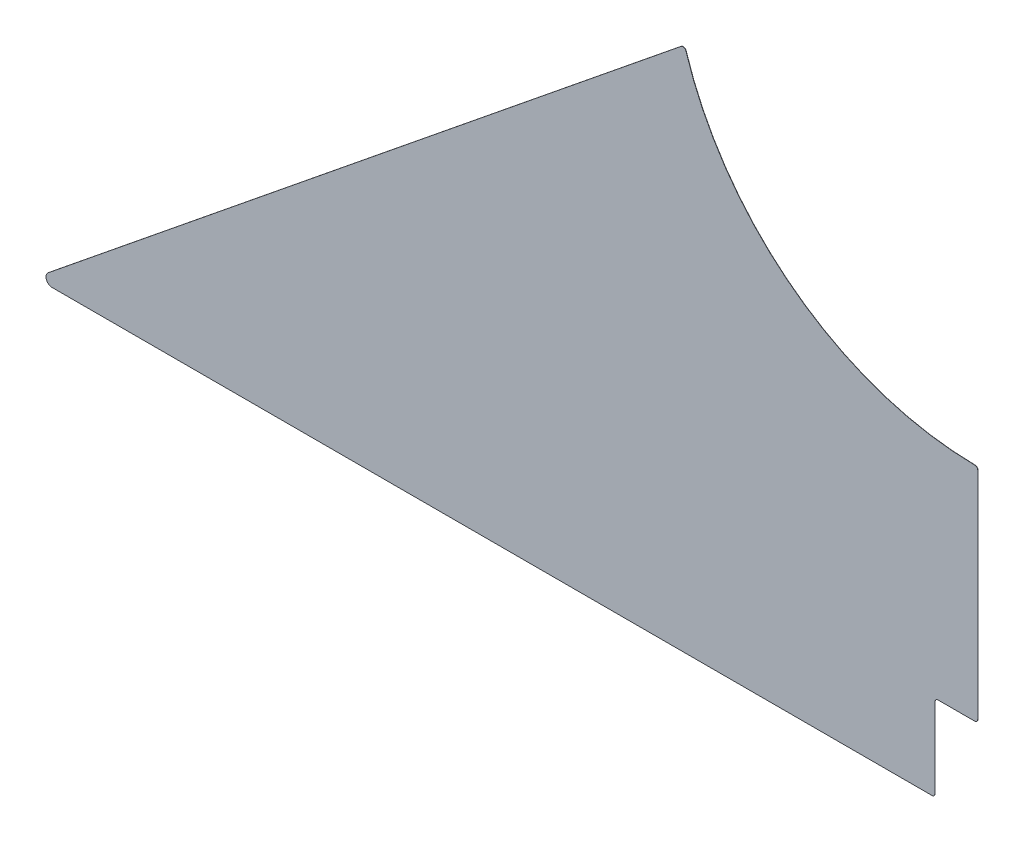
ISO-10303-21;
HEADER;
FILE_DESCRIPTION(('STEP AP214'),'2;1');
FILE_NAME('part.step','',(''),(''),'','','');
FILE_SCHEMA(('AUTOMOTIVE_DESIGN { 1 0 10303 214 1 1 1 1 }'));
ENDSEC;
DATA;
#1=APPLICATION_CONTEXT('core data for automotive mechanical design processes');
#2=APPLICATION_PROTOCOL_DEFINITION('international standard','automotive_design',2000,#1);
#3=PRODUCT_CONTEXT('',#1,'mechanical');
#4=PRODUCT('Part','Part','',(#3));
#5=PRODUCT_RELATED_PRODUCT_CATEGORY('part','',(#4));
#6=PRODUCT_DEFINITION_FORMATION('','',#4);
#7=PRODUCT_DEFINITION_CONTEXT('part definition',#1,'design');
#8=PRODUCT_DEFINITION('design','',#6,#7);
#9=PRODUCT_DEFINITION_SHAPE('','',#8);
#10=(LENGTH_UNIT() NAMED_UNIT(*) SI_UNIT(.MILLI.,.METRE.));
#11=(NAMED_UNIT(*) PLANE_ANGLE_UNIT() SI_UNIT($,.RADIAN.));
#12=(NAMED_UNIT(*) SI_UNIT($,.STERADIAN.) SOLID_ANGLE_UNIT());
#13=UNCERTAINTY_MEASURE_WITH_UNIT(LENGTH_MEASURE(1.E-05),#10,'distance_accuracy_value','');
#14=(GEOMETRIC_REPRESENTATION_CONTEXT(3) GLOBAL_UNCERTAINTY_ASSIGNED_CONTEXT((#13)) GLOBAL_UNIT_ASSIGNED_CONTEXT((#10,
#11,#12)) REPRESENTATION_CONTEXT('',''));
#15=CARTESIAN_POINT('',(0.,0.,0.));
#16=DIRECTION('',(0.,0.,1.));
#17=DIRECTION('',(1.,0.,0.));
#18=AXIS2_PLACEMENT_3D('',#15,#16,#17);
#19=CARTESIAN_POINT('',(-1292.225,-3.17670318081826E-13,1.5875));
#20=DIRECTION('',(0.629320391049834,-0.777145961456974,0.));
#21=DIRECTION('',(0.777145961456974,0.629320391049834,0.));
#22=AXIS2_PLACEMENT_3D('',#19,#20,#21);
#23=PLANE('',#22);
#24=DIRECTION('',(0.,0.,-1.));
#25=VECTOR('',#24,1.);
#26=CARTESIAN_POINT('',(-307.961691260842,797.04071187665,1.5875));
#27=LINE('',#26,#25);
#28=CARTESIAN_POINT('',(-307.961691260842,797.04071187665,1.5875));
#29=VERTEX_POINT('',#28);
#30=CARTESIAN_POINT('',(-307.961691260842,797.04071187665,1.3335));
#31=VERTEX_POINT('',#30);
#32=EDGE_CURVE('E175',#29,#31,#27,.T.);
#33=ORIENTED_EDGE('',*,*,#32,.T.);
#34=DIRECTION('',(-0.777145961456974,-0.629320391049834,0.));
#35=VECTOR('',#34,1.);
#36=CARTESIAN_POINT('',(-1292.225,-3.17658004608335E-13,1.3334999999999));
#37=LINE('',#36,#35);
#38=CARTESIAN_POINT('',(-964.74529205127,265.187838692242,1.33349999999993));
#39=VERTEX_POINT('',#38);
#40=EDGE_CURVE('E192',#31,#39,#37,.T.);
#41=ORIENTED_EDGE('',*,*,#40,.T.);
#42=DIRECTION('',(0.,0.,1.));
#43=VECTOR('',#42,1.);
#44=CARTESIAN_POINT('',(-964.74529205127,265.187838692242,1.5875));
#45=LINE('',#44,#43);
#46=CARTESIAN_POINT('',(-964.74529205127,265.187838692242,1.5875));
#47=VERTEX_POINT('',#46);
#48=EDGE_CURVE('E58',#39,#47,#45,.T.);
#49=ORIENTED_EDGE('',*,*,#48,.T.);
#50=DIRECTION('',(-0.777145961456974,-0.629320391049834,0.));
#51=VECTOR('',#50,1.);
#52=CARTESIAN_POINT('',(-1292.225,-3.17670318081826E-13,1.5875));
#53=LINE('',#52,#51);
#54=EDGE_CURVE('E220',#29,#47,#53,.T.);
#55=ORIENTED_EDGE('',*,*,#54,.F.);
#56=EDGE_LOOP('',(#33,#41,#49,#55));
#57=FACE_BOUND('',#56,.T.);
#58=ADVANCED_FACE('F35',(#57),#23,.F.);
#59=CARTESIAN_POINT('',(0.,890.5875,1.5875));
#60=DIRECTION('',(0.,0.,-1.));
#61=DIRECTION('',(-1.,0.,0.));
#62=AXIS2_PLACEMENT_3D('',#59,#60,#61);
#63=CYLINDRICAL_SURFACE('',#62,317.5);
#64=DIRECTION('',(0.,0.,-1.));
#65=VECTOR('',#64,1.);
#66=CARTESIAN_POINT('',(-3.14356435643564,573.103062581192,1.5875));
#67=LINE('',#66,#65);
#68=CARTESIAN_POINT('',(-3.14356435643564,573.103062581192,1.5875));
#69=VERTEX_POINT('',#68);
#70=CARTESIAN_POINT('',(-3.14356435643564,573.103062581192,1.33349999999997));
#71=VERTEX_POINT('',#70);
#72=EDGE_CURVE('E155',#69,#71,#67,.T.);
#73=ORIENTED_EDGE('',*,*,#72,.T.);
#74=CARTESIAN_POINT('',(0.,890.5875,1.33350000000001));
#75=DIRECTION('',(0.,0.,1.));
#76=DIRECTION('',(0.,-1.,0.));
#77=AXIS2_PLACEMENT_3D('',#74,#75,#76);
#78=CIRCLE('',#77,317.5);
#79=CARTESIAN_POINT('',(-302.934256454712,795.523909355469,1.3335));
#80=VERTEX_POINT('',#79);
#81=EDGE_CURVE('E131',#71,#80,#78,.F.);
#82=ORIENTED_EDGE('',*,*,#81,.T.);
#83=DIRECTION('',(0.,0.,-1.));
#84=VECTOR('',#83,1.);
#85=CARTESIAN_POINT('',(-302.934256454712,795.523909355469,1.5875));
#86=LINE('',#85,#84);
#87=CARTESIAN_POINT('',(-302.934256454712,795.523909355469,1.5875));
#88=VERTEX_POINT('',#87);
#89=EDGE_CURVE('E225',#80,#88,#86,.F.);
#90=ORIENTED_EDGE('',*,*,#89,.T.);
#91=CARTESIAN_POINT('',(0.,890.5875,1.5875));
#92=DIRECTION('',(0.,0.,-1.));
#93=DIRECTION('',(1.,0.,0.));
#94=AXIS2_PLACEMENT_3D('',#91,#92,#93);
#95=CIRCLE('',#94,317.5);
#96=EDGE_CURVE('E222',#69,#88,#95,.T.);
#97=ORIENTED_EDGE('',*,*,#96,.F.);
#98=EDGE_LOOP('',(#73,#82,#90,#97));
#99=FACE_BOUND('',#98,.T.);
#100=ADVANCED_FACE('F228',(#99),#63,.F.);
#101=CARTESIAN_POINT('',(0.,890.5875,1.5875));
#102=DIRECTION('',(0.,0.,1.));
#103=DIRECTION('',(1.,0.,0.));
#104=AXIS2_PLACEMENT_3D('',#101,#102,#103);
#105=PLANE('',#104);
#106=ORIENTED_EDGE('',*,*,#54,.T.);
#107=CARTESIAN_POINT('',(-960.749107568104,260.25296183699,1.5875));
#108=DIRECTION('',(0.,0.,1.));
#109=DIRECTION('',(1.,0.,0.));
#110=AXIS2_PLACEMENT_3D('',#107,#108,#109);
#111=CIRCLE('',#110,6.35);
#112=CARTESIAN_POINT('',(-960.749107568104,253.90296183699,1.5875));
#113=VERTEX_POINT('',#112);
#114=EDGE_CURVE('E50',#47,#113,#111,.T.);
#115=ORIENTED_EDGE('',*,*,#114,.T.);
#116=DIRECTION('',(-1.,0.,0.));
#117=VECTOR('',#116,1.);
#118=CARTESIAN_POINT('',(-44.45,253.902961836991,1.5875));
#119=LINE('',#118,#117);
#120=CARTESIAN_POINT('',(-47.625,253.902961836991,1.5875));
#121=VERTEX_POINT('',#120);
#122=EDGE_CURVE('E188',#121,#113,#119,.T.);
#123=ORIENTED_EDGE('',*,*,#122,.F.);
#124=CARTESIAN_POINT('',(-47.625,257.077961836991,1.5875));
#125=DIRECTION('',(0.,0.,1.));
#126=DIRECTION('',(1.,0.,0.));
#127=AXIS2_PLACEMENT_3D('',#124,#125,#126);
#128=CIRCLE('',#127,3.175);
#129=CARTESIAN_POINT('',(-44.45,257.077961836991,1.5875));
#130=VERTEX_POINT('',#129);
#131=EDGE_CURVE('E153',#121,#130,#128,.T.);
#132=ORIENTED_EDGE('',*,*,#131,.T.);
#133=DIRECTION('',(0.,-1.,0.));
#134=VECTOR('',#133,1.);
#135=CARTESIAN_POINT('',(-44.4499999999999,-3.33066907387547E-13,1.5875));
#136=LINE('',#135,#134);
#137=CARTESIAN_POINT('',(-44.45,339.725,1.5875));
#138=VERTEX_POINT('',#137);
#139=EDGE_CURVE('E214',#138,#130,#136,.T.);
#140=ORIENTED_EDGE('',*,*,#139,.F.);
#141=CARTESIAN_POINT('',(-41.275,339.725,1.5875));
#142=DIRECTION('',(0.,0.,1.));
#143=DIRECTION('',(1.,0.,0.));
#144=AXIS2_PLACEMENT_3D('',#141,#142,#143);
#145=CIRCLE('',#144,3.175);
#146=CARTESIAN_POINT('',(-41.275,342.9,1.5875));
#147=VERTEX_POINT('',#146);
#148=EDGE_CURVE('E178',#138,#147,#145,.F.);
#149=ORIENTED_EDGE('',*,*,#148,.T.);
#150=DIRECTION('',(-1.,0.,0.));
#151=VECTOR('',#150,1.);
#152=CARTESIAN_POINT('',(-44.45,342.9,1.5875));
#153=LINE('',#152,#151);
#154=CARTESIAN_POINT('',(-3.175,342.9,1.5875));
#155=VERTEX_POINT('',#154);
#156=EDGE_CURVE('E217',#155,#147,#153,.T.);
#157=ORIENTED_EDGE('',*,*,#156,.F.);
#158=CARTESIAN_POINT('',(-3.175,346.075,1.5875));
#159=DIRECTION('',(0.,0.,1.));
#160=DIRECTION('',(1.,0.,0.));
#161=AXIS2_PLACEMENT_3D('',#158,#159,#160);
#162=CIRCLE('',#161,3.175);
#163=CARTESIAN_POINT('',(0.,346.075,1.5875));
#164=VERTEX_POINT('',#163);
#165=EDGE_CURVE('E160',#155,#164,#162,.T.);
#166=ORIENTED_EDGE('',*,*,#165,.T.);
#167=DIRECTION('',(0.,-1.,0.));
#168=VECTOR('',#167,1.);
#169=CARTESIAN_POINT('',(0.,0.,1.5875));
#170=LINE('',#169,#168);
#171=CARTESIAN_POINT('',(0.,569.928218207004,1.5875));
#172=VERTEX_POINT('',#171);
#173=EDGE_CURVE('E212',#172,#164,#170,.T.);
#174=ORIENTED_EDGE('',*,*,#173,.F.);
#175=CARTESIAN_POINT('',(-3.175,569.928218207004,1.5875));
#176=DIRECTION('',(0.,0.,1.));
#177=DIRECTION('',(1.,0.,0.));
#178=AXIS2_PLACEMENT_3D('',#175,#176,#177);
#179=CIRCLE('',#178,3.175);
#180=EDGE_CURVE('E150',#172,#69,#179,.T.);
#181=ORIENTED_EDGE('',*,*,#180,.T.);
#182=ORIENTED_EDGE('',*,*,#96,.T.);
#183=CARTESIAN_POINT('',(-305.963599019259,794.573273449024,1.5875));
#184=DIRECTION('',(0.,0.,1.));
#185=DIRECTION('',(1.,0.,0.));
#186=AXIS2_PLACEMENT_3D('',#183,#184,#185);
#187=CIRCLE('',#186,3.175);
#188=EDGE_CURVE('E151',#88,#29,#187,.T.);
#189=ORIENTED_EDGE('',*,*,#188,.T.);
#190=EDGE_LOOP('',(#106,#115,#123,#132,#140,#149,#157,#166,#174,#181,#182,#189));
#191=FACE_BOUND('',#190,.T.);
#192=ADVANCED_FACE('F231',(#191),#105,.T.);
#193=CARTESIAN_POINT('',(-44.4499999999999,-3.33066907387547E-13,0.));
#194=DIRECTION('',(-1.,0.,0.));
#195=DIRECTION('',(0.,-1.,0.));
#196=AXIS2_PLACEMENT_3D('',#193,#194,#195);
#197=PLANE('',#196);
#198=DIRECTION('',(0.,0.,1.));
#199=VECTOR('',#198,1.);
#200=CARTESIAN_POINT('',(-44.45,257.077961836991,0.));
#201=LINE('',#200,#199);
#202=CARTESIAN_POINT('',(-44.45,257.077961836991,1.33349999999993));
#203=VERTEX_POINT('',#202);
#204=EDGE_CURVE('E163',#130,#203,#201,.F.);
#205=ORIENTED_EDGE('',*,*,#204,.T.);
#206=DIRECTION('',(0.,1.,0.));
#207=VECTOR('',#206,1.);
#208=CARTESIAN_POINT('',(-44.4499999999999,-3.33230135994949E-13,1.3334999999999));
#209=LINE('',#208,#207);
#210=CARTESIAN_POINT('',(-44.45,339.725,1.33349999999994));
#211=VERTEX_POINT('',#210);
#212=EDGE_CURVE('E200',#203,#211,#209,.T.);
#213=ORIENTED_EDGE('',*,*,#212,.T.);
#214=DIRECTION('',(0.,0.,1.));
#215=VECTOR('',#214,1.);
#216=CARTESIAN_POINT('',(-44.45,339.725,1.5875));
#217=LINE('',#216,#215);
#218=EDGE_CURVE('E166',#211,#138,#217,.T.);
#219=ORIENTED_EDGE('',*,*,#218,.T.);
#220=ORIENTED_EDGE('',*,*,#139,.T.);
#221=EDGE_LOOP('',(#205,#213,#219,#220));
#222=FACE_BOUND('',#221,.T.);
#223=ADVANCED_FACE('F274',(#222),#197,.F.);
#224=CARTESIAN_POINT('',(-44.45,342.9,0.));
#225=DIRECTION('',(0.,1.,0.));
#226=DIRECTION('',(0.,0.,1.));
#227=AXIS2_PLACEMENT_3D('',#224,#225,#226);
#228=PLANE('',#227);
#229=DIRECTION('',(0.,0.,1.));
#230=VECTOR('',#229,1.);
#231=CARTESIAN_POINT('',(-41.275,342.9,0.));
#232=LINE('',#231,#230);
#233=CARTESIAN_POINT('',(-41.275,342.9,1.33349999999994));
#234=VERTEX_POINT('',#233);
#235=EDGE_CURVE('E170',#147,#234,#232,.F.);
#236=ORIENTED_EDGE('',*,*,#235,.T.);
#237=DIRECTION('',(1.,0.,0.));
#238=VECTOR('',#237,1.);
#239=CARTESIAN_POINT('',(-44.45,342.9,1.33349999999994));
#240=LINE('',#239,#238);
#241=CARTESIAN_POINT('',(-3.175,342.9,1.33349999999994));
#242=VERTEX_POINT('',#241);
#243=EDGE_CURVE('E206',#234,#242,#240,.T.);
#244=ORIENTED_EDGE('',*,*,#243,.T.);
#245=DIRECTION('',(0.,0.,1.));
#246=VECTOR('',#245,1.);
#247=CARTESIAN_POINT('',(-3.175,342.9,0.));
#248=LINE('',#247,#246);
#249=EDGE_CURVE('E168',#242,#155,#248,.T.);
#250=ORIENTED_EDGE('',*,*,#249,.T.);
#251=ORIENTED_EDGE('',*,*,#156,.T.);
#252=EDGE_LOOP('',(#236,#244,#250,#251));
#253=FACE_BOUND('',#252,.T.);
#254=ADVANCED_FACE('F271',(#253),#228,.F.);
#255=CARTESIAN_POINT('',(0.,0.,0.));
#256=DIRECTION('',(-1.,0.,0.));
#257=DIRECTION('',(0.,0.,1.));
#258=AXIS2_PLACEMENT_3D('',#255,#256,#257);
#259=PLANE('',#258);
#260=DIRECTION('',(0.,0.,1.));
#261=VECTOR('',#260,1.);
#262=CARTESIAN_POINT('',(0.,346.075,0.));
#263=LINE('',#262,#261);
#264=CARTESIAN_POINT('',(0.,346.075,1.33349999999994));
#265=VERTEX_POINT('',#264);
#266=EDGE_CURVE('E145',#164,#265,#263,.F.);
#267=ORIENTED_EDGE('',*,*,#266,.T.);
#268=DIRECTION('',(0.,-1.,0.));
#269=VECTOR('',#268,1.);
#270=CARTESIAN_POINT('',(0.,797.748273449024,1.3335));
#271=LINE('',#270,#269);
#272=CARTESIAN_POINT('',(0.,569.928218207004,1.33349999999997));
#273=VERTEX_POINT('',#272);
#274=EDGE_CURVE('E128',#273,#265,#271,.T.);
#275=ORIENTED_EDGE('',*,*,#274,.F.);
#276=DIRECTION('',(0.,0.,-1.));
#277=VECTOR('',#276,1.);
#278=CARTESIAN_POINT('',(0.,569.928218207004,0.));
#279=LINE('',#278,#277);
#280=EDGE_CURVE('E142',#273,#172,#279,.F.);
#281=ORIENTED_EDGE('',*,*,#280,.T.);
#282=ORIENTED_EDGE('',*,*,#173,.T.);
#283=EDGE_LOOP('',(#267,#275,#281,#282));
#284=FACE_BOUND('',#283,.T.);
#285=ADVANCED_FACE('F140',(#284),#259,.F.);
#286=CARTESIAN_POINT('',(-44.45,253.902961836991,0.));
#287=DIRECTION('',(0.,1.,0.));
#288=DIRECTION('',(-1.,0.,0.));
#289=AXIS2_PLACEMENT_3D('',#286,#287,#288);
#290=PLANE('',#289);
#291=DIRECTION('',(0.,0.,1.));
#292=VECTOR('',#291,1.);
#293=CARTESIAN_POINT('',(-960.749107568104,253.90296183699,0.));
#294=LINE('',#293,#292);
#295=CARTESIAN_POINT('',(-960.749107568104,253.902961836991,1.33349999999993));
#296=VERTEX_POINT('',#295);
#297=EDGE_CURVE('E43',#113,#296,#294,.F.);
#298=ORIENTED_EDGE('',*,*,#297,.T.);
#299=DIRECTION('',(1.,0.,0.));
#300=VECTOR('',#299,1.);
#301=CARTESIAN_POINT('',(-967.099107568104,253.902961836991,1.33349999999993));
#302=LINE('',#301,#300);
#303=CARTESIAN_POINT('',(-47.625,253.902961836991,1.33349999999993));
#304=VERTEX_POINT('',#303);
#305=EDGE_CURVE('E146',#296,#304,#302,.T.);
#306=ORIENTED_EDGE('',*,*,#305,.T.);
#307=DIRECTION('',(0.,0.,1.));
#308=VECTOR('',#307,1.);
#309=CARTESIAN_POINT('',(-47.625,253.902961836991,0.));
#310=LINE('',#309,#308);
#311=EDGE_CURVE('E173',#304,#121,#310,.T.);
#312=ORIENTED_EDGE('',*,*,#311,.T.);
#313=ORIENTED_EDGE('',*,*,#122,.T.);
#314=EDGE_LOOP('',(#298,#306,#312,#313));
#315=FACE_BOUND('',#314,.T.);
#316=ADVANCED_FACE('F185',(#315),#290,.F.);
#317=CARTESIAN_POINT('',(-3.175,569.928218207004,1.5875));
#318=DIRECTION('',(0.,0.,-1.));
#319=DIRECTION('',(-1.,0.,0.));
#320=AXIS2_PLACEMENT_3D('',#317,#318,#319);
#321=CYLINDRICAL_SURFACE('',#320,3.175);
#322=CARTESIAN_POINT('',(-3.175,569.928218207004,1.33349999999997));
#323=DIRECTION('',(0.,0.,1.));
#324=DIRECTION('',(0.,-1.,0.));
#325=AXIS2_PLACEMENT_3D('',#322,#323,#324);
#326=CIRCLE('',#325,3.175);
#327=EDGE_CURVE('E125',#71,#273,#326,.F.);
#328=ORIENTED_EDGE('',*,*,#327,.F.);
#329=ORIENTED_EDGE('',*,*,#72,.F.);
#330=ORIENTED_EDGE('',*,*,#180,.F.);
#331=ORIENTED_EDGE('',*,*,#280,.F.);
#332=EDGE_LOOP('',(#328,#329,#330,#331));
#333=FACE_BOUND('',#332,.T.);
#334=ADVANCED_FACE('F149',(#333),#321,.T.);
#335=CARTESIAN_POINT('',(-41.275,339.725,0.));
#336=DIRECTION('',(0.,0.,-1.));
#337=DIRECTION('',(-1.,0.,0.));
#338=AXIS2_PLACEMENT_3D('',#335,#336,#337);
#339=CYLINDRICAL_SURFACE('',#338,3.175);
#340=ORIENTED_EDGE('',*,*,#218,.F.);
#341=CARTESIAN_POINT('',(-41.275,339.725,1.33349999999994));
#342=DIRECTION('',(0.,0.,1.));
#343=DIRECTION('',(0.,-1.,0.));
#344=AXIS2_PLACEMENT_3D('',#341,#342,#343);
#345=CIRCLE('',#344,3.175);
#346=EDGE_CURVE('E203',#211,#234,#345,.F.);
#347=ORIENTED_EDGE('',*,*,#346,.T.);
#348=ORIENTED_EDGE('',*,*,#235,.F.);
#349=ORIENTED_EDGE('',*,*,#148,.F.);
#350=EDGE_LOOP('',(#340,#347,#348,#349));
#351=FACE_BOUND('',#350,.T.);
#352=ADVANCED_FACE('F245',(#351),#339,.F.);
#353=CARTESIAN_POINT('',(-3.175,346.075,0.));
#354=DIRECTION('',(0.,0.,1.));
#355=DIRECTION('',(1.,0.,0.));
#356=AXIS2_PLACEMENT_3D('',#353,#354,#355);
#357=CYLINDRICAL_SURFACE('',#356,3.175);
#358=CARTESIAN_POINT('',(-3.175,346.075,1.33349999999994));
#359=DIRECTION('',(0.,0.,1.));
#360=DIRECTION('',(0.,-1.,0.));
#361=AXIS2_PLACEMENT_3D('',#358,#359,#360);
#362=CIRCLE('',#361,3.175);
#363=EDGE_CURVE('E209',#265,#242,#362,.F.);
#364=ORIENTED_EDGE('',*,*,#363,.F.);
#365=ORIENTED_EDGE('',*,*,#266,.F.);
#366=ORIENTED_EDGE('',*,*,#165,.F.);
#367=ORIENTED_EDGE('',*,*,#249,.F.);
#368=EDGE_LOOP('',(#364,#365,#366,#367));
#369=FACE_BOUND('',#368,.T.);
#370=ADVANCED_FACE('F248',(#369),#357,.T.);
#371=CARTESIAN_POINT('',(-47.625,257.077961836991,0.));
#372=DIRECTION('',(0.,0.,1.));
#373=DIRECTION('',(1.,0.,0.));
#374=AXIS2_PLACEMENT_3D('',#371,#372,#373);
#375=CYLINDRICAL_SURFACE('',#374,3.175);
#376=CARTESIAN_POINT('',(-47.625,257.077961836991,1.33349999999993));
#377=DIRECTION('',(0.,0.,1.));
#378=DIRECTION('',(0.,-1.,0.));
#379=AXIS2_PLACEMENT_3D('',#376,#377,#378);
#380=CIRCLE('',#379,3.175);
#381=EDGE_CURVE('E136',#203,#304,#380,.F.);
#382=ORIENTED_EDGE('',*,*,#381,.F.);
#383=ORIENTED_EDGE('',*,*,#204,.F.);
#384=ORIENTED_EDGE('',*,*,#131,.F.);
#385=ORIENTED_EDGE('',*,*,#311,.F.);
#386=EDGE_LOOP('',(#382,#383,#384,#385));
#387=FACE_BOUND('',#386,.T.);
#388=ADVANCED_FACE('F252',(#387),#375,.T.);
#389=CARTESIAN_POINT('',(-305.963599019259,794.573273449024,1.5875));
#390=DIRECTION('',(0.,0.,-1.));
#391=DIRECTION('',(-1.,0.,0.));
#392=AXIS2_PLACEMENT_3D('',#389,#390,#391);
#393=CYLINDRICAL_SURFACE('',#392,3.175);
#394=CARTESIAN_POINT('',(-305.963599019259,794.573273449024,1.3335));
#395=DIRECTION('',(0.,0.,1.));
#396=DIRECTION('',(0.,-1.,0.));
#397=AXIS2_PLACEMENT_3D('',#394,#395,#396);
#398=CIRCLE('',#397,3.175);
#399=EDGE_CURVE('E194',#31,#80,#398,.F.);
#400=ORIENTED_EDGE('',*,*,#399,.F.);
#401=ORIENTED_EDGE('',*,*,#32,.F.);
#402=ORIENTED_EDGE('',*,*,#188,.F.);
#403=ORIENTED_EDGE('',*,*,#89,.F.);
#404=EDGE_LOOP('',(#400,#401,#402,#403));
#405=FACE_BOUND('',#404,.T.);
#406=ADVANCED_FACE('F234',(#405),#393,.T.);
#407=CARTESIAN_POINT('',(-960.749107568104,260.25296183699,1.5875));
#408=DIRECTION('',(0.,0.,1.));
#409=DIRECTION('',(1.,0.,0.));
#410=AXIS2_PLACEMENT_3D('',#407,#408,#409);
#411=CYLINDRICAL_SURFACE('',#410,6.35);
#412=CARTESIAN_POINT('',(-960.749107568104,260.25296183699,1.33349999999993));
#413=DIRECTION('',(0.,0.,1.));
#414=DIRECTION('',(0.,-1.,0.));
#415=AXIS2_PLACEMENT_3D('',#412,#413,#414);
#416=CIRCLE('',#415,6.35);
#417=EDGE_CURVE('E11',#296,#39,#416,.F.);
#418=ORIENTED_EDGE('',*,*,#417,.F.);
#419=ORIENTED_EDGE('',*,*,#297,.F.);
#420=ORIENTED_EDGE('',*,*,#114,.F.);
#421=ORIENTED_EDGE('',*,*,#48,.F.);
#422=EDGE_LOOP('',(#418,#419,#420,#421));
#423=FACE_BOUND('',#422,.T.);
#424=ADVANCED_FACE('F37',(#423),#411,.T.);
#425=CARTESIAN_POINT('',(-967.099107568104,797.748273449024,1.3335));
#426=DIRECTION('',(0.,0.,1.));
#427=DIRECTION('',(0.,-1.,0.));
#428=AXIS2_PLACEMENT_3D('',#425,#426,#427);
#429=PLANE('',#428);
#430=ORIENTED_EDGE('',*,*,#363,.T.);
#431=ORIENTED_EDGE('',*,*,#243,.F.);
#432=ORIENTED_EDGE('',*,*,#346,.F.);
#433=ORIENTED_EDGE('',*,*,#212,.F.);
#434=ORIENTED_EDGE('',*,*,#381,.T.);
#435=ORIENTED_EDGE('',*,*,#305,.F.);
#436=ORIENTED_EDGE('',*,*,#417,.T.);
#437=ORIENTED_EDGE('',*,*,#40,.F.);
#438=ORIENTED_EDGE('',*,*,#399,.T.);
#439=ORIENTED_EDGE('',*,*,#81,.F.);
#440=ORIENTED_EDGE('',*,*,#327,.T.);
#441=ORIENTED_EDGE('',*,*,#274,.T.);
#442=EDGE_LOOP('',(#430,#431,#432,#433,#434,#435,#436,#437,#438,#439,#440,#441));
#443=FACE_BOUND('',#442,.T.);
#444=ADVANCED_FACE('F127',(#443),#429,.F.);
#445=CLOSED_SHELL('',(#58,#100,#192,#223,#254,#285,#316,#334,#352,#370,#388,#406,#424,#444));
#446=MANIFOLD_SOLID_BREP('B2',#445);
#447=ADVANCED_BREP_SHAPE_REPRESENTATION('',(#18,#446),#14);
#448=SHAPE_DEFINITION_REPRESENTATION(#9,#447);
ENDSEC;
END-ISO-10303-21;
